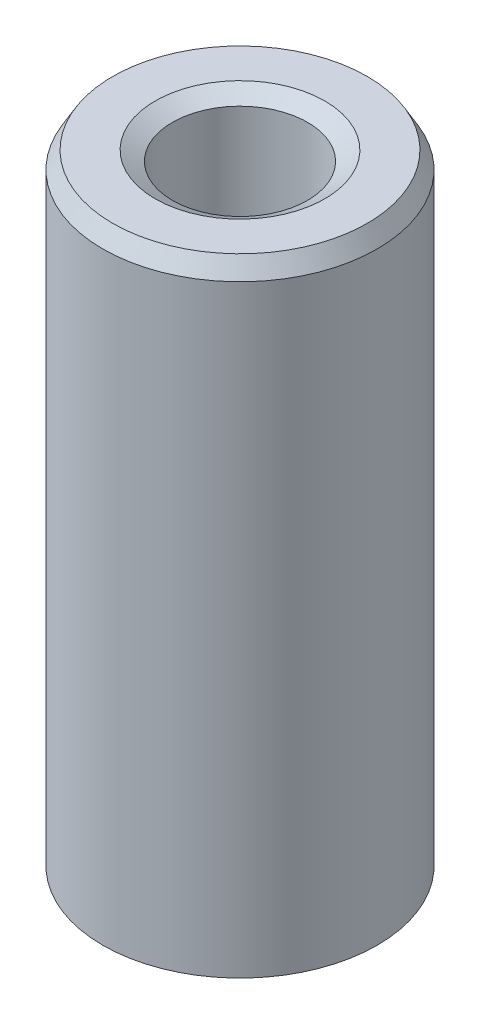
ISO-10303-21;
HEADER;
FILE_DESCRIPTION(('STEP AP214'),'2;1');
FILE_NAME('part.step','',(''),(''),'','','');
FILE_SCHEMA(('AUTOMOTIVE_DESIGN { 1 0 10303 214 1 1 1 1 }'));
ENDSEC;
DATA;
#1=APPLICATION_CONTEXT('core data for automotive mechanical design processes');
#2=APPLICATION_PROTOCOL_DEFINITION('international standard','automotive_design',2000,#1);
#3=PRODUCT_CONTEXT('',#1,'mechanical');
#4=PRODUCT('Part','Part','',(#3));
#5=PRODUCT_RELATED_PRODUCT_CATEGORY('part','',(#4));
#6=PRODUCT_DEFINITION_FORMATION('','',#4);
#7=PRODUCT_DEFINITION_CONTEXT('part definition',#1,'design');
#8=PRODUCT_DEFINITION('design','',#6,#7);
#9=PRODUCT_DEFINITION_SHAPE('','',#8);
#10=(LENGTH_UNIT() NAMED_UNIT(*) SI_UNIT(.MILLI.,.METRE.));
#11=(NAMED_UNIT(*) PLANE_ANGLE_UNIT() SI_UNIT($,.RADIAN.));
#12=(NAMED_UNIT(*) SI_UNIT($,.STERADIAN.) SOLID_ANGLE_UNIT());
#13=UNCERTAINTY_MEASURE_WITH_UNIT(LENGTH_MEASURE(1.E-05),#10,'distance_accuracy_value','');
#14=(GEOMETRIC_REPRESENTATION_CONTEXT(3) GLOBAL_UNCERTAINTY_ASSIGNED_CONTEXT((#13)) GLOBAL_UNIT_ASSIGNED_CONTEXT((#10,
#11,#12)) REPRESENTATION_CONTEXT('',''));
#15=CARTESIAN_POINT('',(0.,0.,0.));
#16=DIRECTION('',(0.,0.,1.));
#17=DIRECTION('',(1.,0.,0.));
#18=AXIS2_PLACEMENT_3D('',#15,#16,#17);
#19=CARTESIAN_POINT('',(0.,103.341447079153,0.));
#20=DIRECTION('',(0.,-1.,0.));
#21=DIRECTION('',(0.,0.,-1.));
#22=AXIS2_PLACEMENT_3D('',#19,#20,#21);
#23=CYLINDRICAL_SURFACE('',#22,22.5);
#24=CARTESIAN_POINT('',(0.,1.62862217063767,0.));
#25=DIRECTION('',(0.,1.,0.));
#26=DIRECTION('',(0.,0.,1.));
#27=AXIS2_PLACEMENT_3D('',#24,#25,#26);
#28=CIRCLE('',#27,22.5);
#29=CARTESIAN_POINT('',(0.,1.62862217063767,22.5));
#30=VERTEX_POINT('',#29);
#31=EDGE_CURVE('E10',#30,#30,#28,.T.);
#32=ORIENTED_EDGE('',*,*,#31,.T.);
#33=EDGE_LOOP('',(#32));
#34=FACE_BOUND('',#33,.T.);
#35=CARTESIAN_POINT('',(0.,100.520590733276,0.));
#36=DIRECTION('',(0.,1.,0.));
#37=DIRECTION('',(0.,0.,1.));
#38=AXIS2_PLACEMENT_3D('',#35,#36,#37);
#39=CIRCLE('',#38,22.5);
#40=CARTESIAN_POINT('',(0.,100.520590733276,22.5));
#41=VERTEX_POINT('',#40);
#42=EDGE_CURVE('E50',#41,#41,#39,.F.);
#43=ORIENTED_EDGE('',*,*,#42,.T.);
#44=EDGE_LOOP('',(#43));
#45=FACE_BOUND('',#44,.T.);
#46=ADVANCED_FACE('F39',(#34,#45),#23,.T.);
#47=CARTESIAN_POINT('',(0.,103.341447079153,0.));
#48=DIRECTION('',(0.,1.,0.));
#49=DIRECTION('',(0.,0.,1.));
#50=AXIS2_PLACEMENT_3D('',#47,#48,#49);
#51=PLANE('',#50);
#52=CARTESIAN_POINT('',(0.,103.341447079153,0.));
#53=DIRECTION('',(0.,1.,0.));
#54=DIRECTION('',(0.,0.,1.));
#55=AXIS2_PLACEMENT_3D('',#52,#53,#54);
#56=CIRCLE('',#55,13.908068965169);
#57=CARTESIAN_POINT('',(0.,103.341447079153,13.908068965169));
#58=VERTEX_POINT('',#57);
#59=EDGE_CURVE('E58',#58,#58,#56,.F.);
#60=ORIENTED_EDGE('',*,*,#59,.T.);
#61=EDGE_LOOP('',(#60));
#62=FACE_BOUND('',#61,.T.);
#63=CARTESIAN_POINT('',(0.,103.341447079153,0.));
#64=DIRECTION('',(0.,1.,0.));
#65=DIRECTION('',(0.,0.,1.));
#66=AXIS2_PLACEMENT_3D('',#63,#64,#65);
#67=CIRCLE('',#66,20.8713778293623);
#68=CARTESIAN_POINT('',(0.,103.341447079153,20.8713778293623));
#69=VERTEX_POINT('',#68);
#70=EDGE_CURVE('E61',#69,#69,#67,.T.);
#71=ORIENTED_EDGE('',*,*,#70,.T.);
#72=EDGE_LOOP('',(#71));
#73=FACE_BOUND('',#72,.T.);
#74=ADVANCED_FACE('F88',(#62,#73),#51,.T.);
#75=CARTESIAN_POINT('',(0.,0.,0.));
#76=DIRECTION('',(0.,1.,0.));
#77=DIRECTION('',(0.,0.,1.));
#78=AXIS2_PLACEMENT_3D('',#75,#76,#77);
#79=PLANE('',#78);
#80=CARTESIAN_POINT('',(0.,0.,0.));
#81=DIRECTION('',(0.,1.,0.));
#82=DIRECTION('',(0.,0.,1.));
#83=AXIS2_PLACEMENT_3D('',#80,#81,#82);
#84=CIRCLE('',#83,12.715834789929);
#85=CARTESIAN_POINT('',(0.,0.,12.715834789929));
#86=VERTEX_POINT('',#85);
#87=EDGE_CURVE('E51',#86,#86,#84,.T.);
#88=ORIENTED_EDGE('',*,*,#87,.T.);
#89=EDGE_LOOP('',(#88));
#90=FACE_BOUND('',#89,.T.);
#91=CARTESIAN_POINT('',(0.,0.,0.));
#92=DIRECTION('',(0.,1.,0.));
#93=DIRECTION('',(0.,0.,1.));
#94=AXIS2_PLACEMENT_3D('',#91,#92,#93);
#95=CIRCLE('',#94,19.6791436541224);
#96=CARTESIAN_POINT('',(0.,0.,19.6791436541224));
#97=VERTEX_POINT('',#96);
#98=EDGE_CURVE('E54',#97,#97,#95,.F.);
#99=ORIENTED_EDGE('',*,*,#98,.T.);
#100=EDGE_LOOP('',(#99));
#101=FACE_BOUND('',#100,.T.);
#102=ADVANCED_FACE('F83',(#90,#101),#79,.F.);
#103=CARTESIAN_POINT('',(0.,103.341447079153,0.));
#104=DIRECTION('',(0.,-1.,0.));
#105=DIRECTION('',(0.,0.,-1.));
#106=AXIS2_PLACEMENT_3D('',#103,#104,#105);
#107=CYLINDRICAL_SURFACE('',#106,11.0872126192914);
#108=CARTESIAN_POINT('',(0.,101.712824908516,0.));
#109=DIRECTION('',(0.,1.,0.));
#110=DIRECTION('',(0.,0.,1.));
#111=AXIS2_PLACEMENT_3D('',#108,#109,#110);
#112=CIRCLE('',#111,11.0872126192914);
#113=CARTESIAN_POINT('',(0.,101.712824908516,11.0872126192914));
#114=VERTEX_POINT('',#113);
#115=EDGE_CURVE('E67',#114,#114,#112,.T.);
#116=ORIENTED_EDGE('',*,*,#115,.T.);
#117=EDGE_LOOP('',(#116));
#118=FACE_BOUND('',#117,.T.);
#119=CARTESIAN_POINT('',(0.,2.82085634587756,0.));
#120=DIRECTION('',(0.,1.,0.));
#121=DIRECTION('',(0.,0.,1.));
#122=AXIS2_PLACEMENT_3D('',#119,#120,#121);
#123=CIRCLE('',#122,11.0872126192914);
#124=CARTESIAN_POINT('',(0.,2.82085634587756,11.0872126192914));
#125=VERTEX_POINT('',#124);
#126=EDGE_CURVE('E69',#125,#125,#123,.F.);
#127=ORIENTED_EDGE('',*,*,#126,.T.);
#128=EDGE_LOOP('',(#127));
#129=FACE_BOUND('',#128,.T.);
#130=ADVANCED_FACE('F71',(#118,#129),#107,.F.);
#131=CARTESIAN_POINT('',(0.,101.712824908516,0.));
#132=DIRECTION('',(0.,1.,0.));
#133=DIRECTION('',(0.,0.,1.));
#134=AXIS2_PLACEMENT_3D('',#131,#132,#133);
#135=CONICAL_SURFACE('',#134,11.0872126192914,1.0471975511966);
#136=ORIENTED_EDGE('',*,*,#59,.F.);
#137=EDGE_LOOP('',(#136));
#138=FACE_BOUND('',#137,.T.);
#139=ORIENTED_EDGE('',*,*,#115,.F.);
#140=EDGE_LOOP('',(#139));
#141=FACE_BOUND('',#140,.T.);
#142=ADVANCED_FACE('F77',(#138,#141),#135,.F.);
#143=CARTESIAN_POINT('',(0.,0.,0.));
#144=DIRECTION('',(0.,-1.,0.));
#145=DIRECTION('',(0.,0.,-1.));
#146=AXIS2_PLACEMENT_3D('',#143,#144,#145);
#147=CONICAL_SURFACE('',#146,12.715834789929,0.523598775598295);
#148=ORIENTED_EDGE('',*,*,#126,.F.);
#149=EDGE_LOOP('',(#148));
#150=FACE_BOUND('',#149,.T.);
#151=ORIENTED_EDGE('',*,*,#87,.F.);
#152=EDGE_LOOP('',(#151));
#153=FACE_BOUND('',#152,.T.);
#154=ADVANCED_FACE('F73',(#150,#153),#147,.F.);
#155=CARTESIAN_POINT('',(0.,1.62862217063767,0.));
#156=DIRECTION('',(0.,1.,0.));
#157=DIRECTION('',(0.,0.,1.));
#158=AXIS2_PLACEMENT_3D('',#155,#156,#157);
#159=CONICAL_SURFACE('',#158,22.5,1.0471975511966);
#160=ORIENTED_EDGE('',*,*,#98,.F.);
#161=EDGE_LOOP('',(#160));
#162=FACE_BOUND('',#161,.T.);
#163=ORIENTED_EDGE('',*,*,#31,.F.);
#164=EDGE_LOOP('',(#163));
#165=FACE_BOUND('',#164,.T.);
#166=ADVANCED_FACE('F76',(#162,#165),#159,.T.);
#167=CARTESIAN_POINT('',(0.,103.341447079153,0.));
#168=DIRECTION('',(0.,-1.,0.));
#169=DIRECTION('',(0.,0.,-1.));
#170=AXIS2_PLACEMENT_3D('',#167,#168,#169);
#171=CONICAL_SURFACE('',#170,20.8713778293623,0.523598775598296);
#172=ORIENTED_EDGE('',*,*,#42,.F.);
#173=EDGE_LOOP('',(#172));
#174=FACE_BOUND('',#173,.T.);
#175=ORIENTED_EDGE('',*,*,#70,.F.);
#176=EDGE_LOOP('',(#175));
#177=FACE_BOUND('',#176,.T.);
#178=ADVANCED_FACE('F45',(#174,#177),#171,.T.);
#179=CLOSED_SHELL('',(#46,#74,#102,#130,#142,#154,#166,#178));
#180=MANIFOLD_SOLID_BREP('B2',#179);
#181=ADVANCED_BREP_SHAPE_REPRESENTATION('',(#18,#180),#14);
#182=SHAPE_DEFINITION_REPRESENTATION(#9,#181);
ENDSEC;
END-ISO-10303-21;
